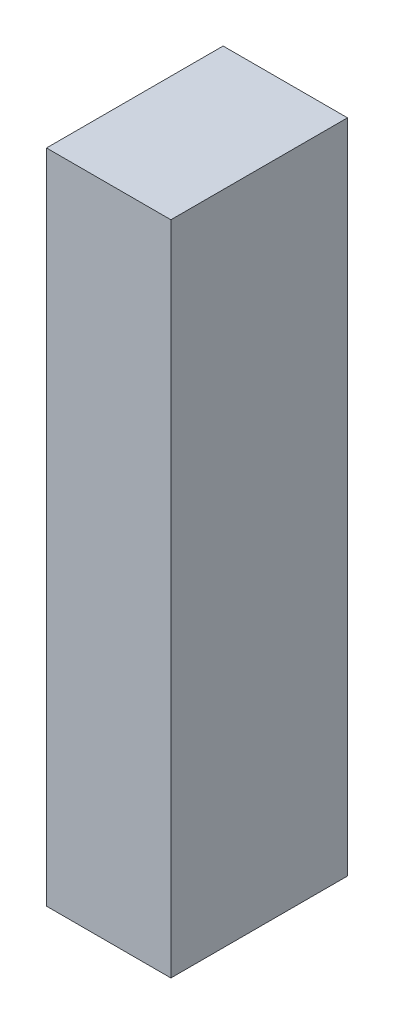
ISO-10303-21;
HEADER;
FILE_DESCRIPTION(('STEP AP214'),'2;1');
FILE_NAME('part.step','',(''),(''),'','','');
FILE_SCHEMA(('AUTOMOTIVE_DESIGN { 1 0 10303 214 1 1 1 1 }'));
ENDSEC;
DATA;
#1=APPLICATION_CONTEXT('core data for automotive mechanical design processes');
#2=APPLICATION_PROTOCOL_DEFINITION('international standard','automotive_design',2000,#1);
#3=PRODUCT_CONTEXT('',#1,'mechanical');
#4=PRODUCT('Part','Part','',(#3));
#5=PRODUCT_RELATED_PRODUCT_CATEGORY('part','',(#4));
#6=PRODUCT_DEFINITION_FORMATION('','',#4);
#7=PRODUCT_DEFINITION_CONTEXT('part definition',#1,'design');
#8=PRODUCT_DEFINITION('design','',#6,#7);
#9=PRODUCT_DEFINITION_SHAPE('','',#8);
#10=(LENGTH_UNIT() NAMED_UNIT(*) SI_UNIT(.MILLI.,.METRE.));
#11=(NAMED_UNIT(*) PLANE_ANGLE_UNIT() SI_UNIT($,.RADIAN.));
#12=(NAMED_UNIT(*) SI_UNIT($,.STERADIAN.) SOLID_ANGLE_UNIT());
#13=UNCERTAINTY_MEASURE_WITH_UNIT(LENGTH_MEASURE(1.E-05),#10,'distance_accuracy_value','');
#14=(GEOMETRIC_REPRESENTATION_CONTEXT(3) GLOBAL_UNCERTAINTY_ASSIGNED_CONTEXT((#13)) GLOBAL_UNIT_ASSIGNED_CONTEXT((#10,
#11,#12)) REPRESENTATION_CONTEXT('',''));
#15=CARTESIAN_POINT('',(0.,0.,0.));
#16=DIRECTION('',(0.,0.,1.));
#17=DIRECTION('',(1.,0.,0.));
#18=AXIS2_PLACEMENT_3D('',#15,#16,#17);
#19=CARTESIAN_POINT('',(-0.2499995,-1.3199999,0.));
#20=DIRECTION('',(-1.,0.,0.));
#21=DIRECTION('',(0.,1.,0.));
#22=AXIS2_PLACEMENT_3D('',#19,#20,#21);
#23=PLANE('',#22);
#24=DIRECTION('',(0.,0.,1.));
#25=VECTOR('',#24,1.);
#26=CARTESIAN_POINT('',(-0.2499995,-1.3199999,0.));
#27=LINE('',#26,#25);
#28=CARTESIAN_POINT('',(-0.2499995,-1.3199999,0.));
#29=VERTEX_POINT('',#28);
#30=CARTESIAN_POINT('',(-0.2499995,-1.3199999,0.71000112));
#31=VERTEX_POINT('',#30);
#32=EDGE_CURVE('E11',#29,#31,#27,.T.);
#33=ORIENTED_EDGE('',*,*,#32,.T.);
#34=DIRECTION('',(0.,1.,0.));
#35=VECTOR('',#34,1.);
#36=CARTESIAN_POINT('',(-0.2499995,-1.3199999,0.71000112));
#37=LINE('',#36,#35);
#38=CARTESIAN_POINT('',(-0.2499995,1.3199999,0.71000112));
#39=VERTEX_POINT('',#38);
#40=EDGE_CURVE('E24',#31,#39,#37,.T.);
#41=ORIENTED_EDGE('',*,*,#40,.T.);
#42=DIRECTION('',(0.,0.,1.));
#43=VECTOR('',#42,1.);
#44=CARTESIAN_POINT('',(-0.2499995,1.3199999,0.));
#45=LINE('',#44,#43);
#46=CARTESIAN_POINT('',(-0.2499995,1.3199999,0.));
#47=VERTEX_POINT('',#46);
#48=EDGE_CURVE('E85',#47,#39,#45,.T.);
#49=ORIENTED_EDGE('',*,*,#48,.F.);
#50=DIRECTION('',(0.,1.,0.));
#51=VECTOR('',#50,1.);
#52=CARTESIAN_POINT('',(-0.2499995,-1.3199999,0.));
#53=LINE('',#52,#51);
#54=EDGE_CURVE('E83',#29,#47,#53,.T.);
#55=ORIENTED_EDGE('',*,*,#54,.F.);
#56=EDGE_LOOP('',(#33,#41,#49,#55));
#57=FACE_BOUND('',#56,.T.);
#58=ADVANCED_FACE('F17',(#57),#23,.T.);
#59=CARTESIAN_POINT('',(-0.2499995,1.3199999,0.));
#60=DIRECTION('',(0.,1.,0.));
#61=DIRECTION('',(1.,0.,0.));
#62=AXIS2_PLACEMENT_3D('',#59,#60,#61);
#63=PLANE('',#62);
#64=ORIENTED_EDGE('',*,*,#48,.T.);
#65=DIRECTION('',(1.,0.,0.));
#66=VECTOR('',#65,1.);
#67=CARTESIAN_POINT('',(-0.2499995,1.3199999,0.71000112));
#68=LINE('',#67,#66);
#69=CARTESIAN_POINT('',(0.2499995,1.3199999,0.71000112));
#70=VERTEX_POINT('',#69);
#71=EDGE_CURVE('E81',#39,#70,#68,.T.);
#72=ORIENTED_EDGE('',*,*,#71,.T.);
#73=DIRECTION('',(0.,0.,1.));
#74=VECTOR('',#73,1.);
#75=CARTESIAN_POINT('',(0.2499995,1.3199999,0.));
#76=LINE('',#75,#74);
#77=CARTESIAN_POINT('',(0.2499995,1.3199999,0.));
#78=VERTEX_POINT('',#77);
#79=EDGE_CURVE('E79',#78,#70,#76,.T.);
#80=ORIENTED_EDGE('',*,*,#79,.F.);
#81=DIRECTION('',(1.,0.,0.));
#82=VECTOR('',#81,1.);
#83=CARTESIAN_POINT('',(-0.2499995,1.3199999,0.));
#84=LINE('',#83,#82);
#85=EDGE_CURVE('E70',#47,#78,#84,.T.);
#86=ORIENTED_EDGE('',*,*,#85,.F.);
#87=EDGE_LOOP('',(#64,#72,#80,#86));
#88=FACE_BOUND('',#87,.T.);
#89=ADVANCED_FACE('F90',(#88),#63,.T.);
#90=CARTESIAN_POINT('',(0.2499995,1.3199999,0.));
#91=DIRECTION('',(1.,0.,0.));
#92=DIRECTION('',(0.,-1.,0.));
#93=AXIS2_PLACEMENT_3D('',#90,#91,#92);
#94=PLANE('',#93);
#95=ORIENTED_EDGE('',*,*,#79,.T.);
#96=DIRECTION('',(0.,-1.,0.));
#97=VECTOR('',#96,1.);
#98=CARTESIAN_POINT('',(0.2499995,1.3199999,0.71000112));
#99=LINE('',#98,#97);
#100=CARTESIAN_POINT('',(0.2499995,-1.3199999,0.71000112));
#101=VERTEX_POINT('',#100);
#102=EDGE_CURVE('E60',#70,#101,#99,.T.);
#103=ORIENTED_EDGE('',*,*,#102,.T.);
#104=DIRECTION('',(0.,0.,1.));
#105=VECTOR('',#104,1.);
#106=CARTESIAN_POINT('',(0.2499995,-1.3199999,0.));
#107=LINE('',#106,#105);
#108=CARTESIAN_POINT('',(0.2499995,-1.3199999,0.));
#109=VERTEX_POINT('',#108);
#110=EDGE_CURVE('E54',#109,#101,#107,.T.);
#111=ORIENTED_EDGE('',*,*,#110,.F.);
#112=DIRECTION('',(0.,-1.,0.));
#113=VECTOR('',#112,1.);
#114=CARTESIAN_POINT('',(0.2499995,1.3199999,0.));
#115=LINE('',#114,#113);
#116=EDGE_CURVE('E58',#78,#109,#115,.T.);
#117=ORIENTED_EDGE('',*,*,#116,.F.);
#118=EDGE_LOOP('',(#95,#103,#111,#117));
#119=FACE_BOUND('',#118,.T.);
#120=ADVANCED_FACE('F57',(#119),#94,.T.);
#121=CARTESIAN_POINT('',(0.2499995,-1.3199999,0.));
#122=DIRECTION('',(0.,-1.,0.));
#123=DIRECTION('',(-1.,0.,0.));
#124=AXIS2_PLACEMENT_3D('',#121,#122,#123);
#125=PLANE('',#124);
#126=ORIENTED_EDGE('',*,*,#110,.T.);
#127=DIRECTION('',(-1.,0.,0.));
#128=VECTOR('',#127,1.);
#129=CARTESIAN_POINT('',(0.2499995,-1.3199999,0.71000112));
#130=LINE('',#129,#128);
#131=EDGE_CURVE('E71',#101,#31,#130,.T.);
#132=ORIENTED_EDGE('',*,*,#131,.T.);
#133=ORIENTED_EDGE('',*,*,#32,.F.);
#134=DIRECTION('',(-1.,0.,0.));
#135=VECTOR('',#134,1.);
#136=CARTESIAN_POINT('',(0.2499995,-1.3199999,0.));
#137=LINE('',#136,#135);
#138=EDGE_CURVE('E68',#109,#29,#137,.T.);
#139=ORIENTED_EDGE('',*,*,#138,.F.);
#140=EDGE_LOOP('',(#126,#132,#133,#139));
#141=FACE_BOUND('',#140,.T.);
#142=ADVANCED_FACE('F73',(#141),#125,.T.);
#143=CARTESIAN_POINT('',(-0.2499995,-1.3199999,0.));
#144=DIRECTION('',(0.,0.,1.));
#145=DIRECTION('',(1.,0.,0.));
#146=AXIS2_PLACEMENT_3D('',#143,#144,#145);
#147=PLANE('',#146);
#148=ORIENTED_EDGE('',*,*,#54,.T.);
#149=ORIENTED_EDGE('',*,*,#85,.T.);
#150=ORIENTED_EDGE('',*,*,#116,.T.);
#151=ORIENTED_EDGE('',*,*,#138,.T.);
#152=EDGE_LOOP('',(#148,#149,#150,#151));
#153=FACE_BOUND('',#152,.T.);
#154=ADVANCED_FACE('F67',(#153),#147,.F.);
#155=CARTESIAN_POINT('',(-0.2499995,-1.3199999,0.71000112));
#156=DIRECTION('',(0.,0.,1.));
#157=DIRECTION('',(1.,0.,0.));
#158=AXIS2_PLACEMENT_3D('',#155,#156,#157);
#159=PLANE('',#158);
#160=ORIENTED_EDGE('',*,*,#131,.F.);
#161=ORIENTED_EDGE('',*,*,#102,.F.);
#162=ORIENTED_EDGE('',*,*,#71,.F.);
#163=ORIENTED_EDGE('',*,*,#40,.F.);
#164=EDGE_LOOP('',(#160,#161,#162,#163));
#165=FACE_BOUND('',#164,.T.);
#166=ADVANCED_FACE('F91',(#165),#159,.T.);
#167=CLOSED_SHELL('',(#58,#89,#120,#142,#154,#166));
#168=MANIFOLD_SOLID_BREP('B1',#167);
#169=ADVANCED_BREP_SHAPE_REPRESENTATION('',(#18,#168),#14);
#170=SHAPE_DEFINITION_REPRESENTATION(#9,#169);
ENDSEC;
END-ISO-10303-21;
